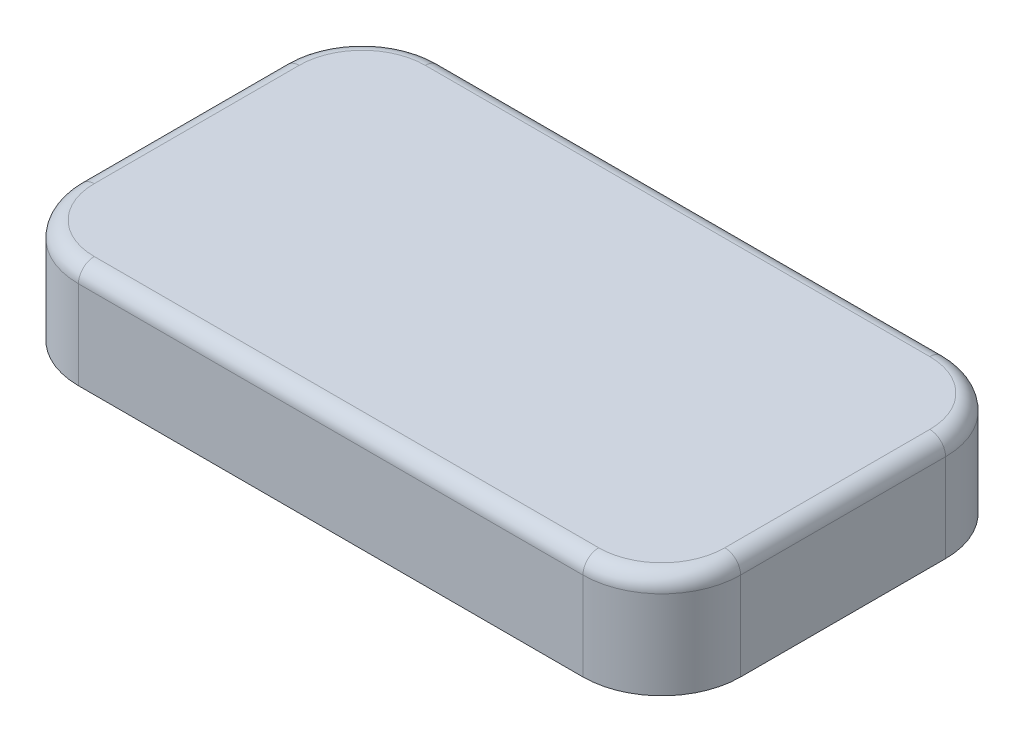
ISO-10303-21;
HEADER;
FILE_DESCRIPTION(('STEP AP214'),'2;1');
FILE_NAME('part.step','',(''),(''),'','','');
FILE_SCHEMA(('AUTOMOTIVE_DESIGN { 1 0 10303 214 1 1 1 1 }'));
ENDSEC;
DATA;
#1=APPLICATION_CONTEXT('core data for automotive mechanical design processes');
#2=APPLICATION_PROTOCOL_DEFINITION('international standard','automotive_design',2000,#1);
#3=PRODUCT_CONTEXT('',#1,'mechanical');
#4=PRODUCT('Part','Part','',(#3));
#5=PRODUCT_RELATED_PRODUCT_CATEGORY('part','',(#4));
#6=PRODUCT_DEFINITION_FORMATION('','',#4);
#7=PRODUCT_DEFINITION_CONTEXT('part definition',#1,'design');
#8=PRODUCT_DEFINITION('design','',#6,#7);
#9=PRODUCT_DEFINITION_SHAPE('','',#8);
#10=(LENGTH_UNIT() NAMED_UNIT(*) SI_UNIT(.MILLI.,.METRE.));
#11=(NAMED_UNIT(*) PLANE_ANGLE_UNIT() SI_UNIT($,.RADIAN.));
#12=(NAMED_UNIT(*) SI_UNIT($,.STERADIAN.) SOLID_ANGLE_UNIT());
#13=UNCERTAINTY_MEASURE_WITH_UNIT(LENGTH_MEASURE(1.E-05),#10,'distance_accuracy_value','');
#14=(GEOMETRIC_REPRESENTATION_CONTEXT(3) GLOBAL_UNCERTAINTY_ASSIGNED_CONTEXT((#13)) GLOBAL_UNIT_ASSIGNED_CONTEXT((#10,
#11,#12)) REPRESENTATION_CONTEXT('',''));
#15=CARTESIAN_POINT('',(0.,0.,0.));
#16=DIRECTION('',(0.,0.,1.));
#17=DIRECTION('',(1.,0.,0.));
#18=AXIS2_PLACEMENT_3D('',#15,#16,#17);
#19=CARTESIAN_POINT('',(0.,1.65,0.));
#20=DIRECTION('',(0.,1.,0.));
#21=DIRECTION('',(0.,0.,1.));
#22=AXIS2_PLACEMENT_3D('',#19,#20,#21);
#23=PLANE('',#22);
#24=DIRECTION('',(1.,0.,0.));
#25=VECTOR('',#24,1.);
#26=CARTESIAN_POINT('',(-4.0185813417536,1.65,2.625));
#27=LINE('',#26,#25);
#28=CARTESIAN_POINT('',(3.99999999998244,1.65,2.625));
#29=VERTEX_POINT('',#28);
#30=CARTESIAN_POINT('',(-3.9999999999735,1.65,2.625));
#31=VERTEX_POINT('',#30);
#32=EDGE_CURVE('E262',#29,#31,#27,.F.);
#33=ORIENTED_EDGE('',*,*,#32,.F.);
#34=CARTESIAN_POINT('',(4.,1.65,1.625));
#35=DIRECTION('',(0.,-1.,0.));
#36=DIRECTION('',(1.,0.,-1.05976208711334E-10));
#37=AXIS2_PLACEMENT_3D('',#34,#35,#36);
#38=CIRCLE('',#37,1.);
#39=CARTESIAN_POINT('',(5.,1.65,1.62499999997351));
#40=VERTEX_POINT('',#39);
#41=EDGE_CURVE('E258',#40,#29,#38,.T.);
#42=ORIENTED_EDGE('',*,*,#41,.F.);
#43=DIRECTION('',(0.,0.,-1.));
#44=VECTOR('',#43,1.);
#45=CARTESIAN_POINT('',(5.,1.65,1.64358134175361));
#46=LINE('',#45,#44);
#47=CARTESIAN_POINT('',(5.,1.65,-1.62499999998244));
#48=VERTEX_POINT('',#47);
#49=EDGE_CURVE('E247',#48,#40,#46,.F.);
#50=ORIENTED_EDGE('',*,*,#49,.F.);
#51=CARTESIAN_POINT('',(4.,1.65,-1.625));
#52=DIRECTION('',(0.,-1.,0.));
#53=DIRECTION('',(-1.05975991870899E-10,0.,-1.));
#54=AXIS2_PLACEMENT_3D('',#51,#52,#53);
#55=CIRCLE('',#54,0.999999999999999);
#56=CARTESIAN_POINT('',(3.99999999997351,1.65,-2.625));
#57=VERTEX_POINT('',#56);
#58=EDGE_CURVE('E222',#57,#48,#55,.T.);
#59=ORIENTED_EDGE('',*,*,#58,.F.);
#60=DIRECTION('',(-1.,0.,0.));
#61=VECTOR('',#60,1.);
#62=CARTESIAN_POINT('',(4.01858134175362,1.65,-2.625));
#63=LINE('',#62,#61);
#64=CARTESIAN_POINT('',(-3.99999999996487,1.65,-2.625));
#65=VERTEX_POINT('',#64);
#66=EDGE_CURVE('E117',#65,#57,#63,.F.);
#67=ORIENTED_EDGE('',*,*,#66,.F.);
#68=CARTESIAN_POINT('',(-3.99999999999999,1.65,-1.625));
#69=DIRECTION('',(0.,-1.,0.));
#70=DIRECTION('',(-1.,0.,1.05976208711334E-10));
#71=AXIS2_PLACEMENT_3D('',#68,#69,#70);
#72=CIRCLE('',#71,0.999999999999998);
#73=CARTESIAN_POINT('',(-5.,1.65,-1.62499999997351));
#74=VERTEX_POINT('',#73);
#75=EDGE_CURVE('E109',#74,#65,#72,.T.);
#76=ORIENTED_EDGE('',*,*,#75,.F.);
#77=DIRECTION('',(0.,0.,1.));
#78=VECTOR('',#77,1.);
#79=CARTESIAN_POINT('',(-5.,1.65,-1.64358134175361));
#80=LINE('',#79,#78);
#81=CARTESIAN_POINT('',(-5.,1.65,1.62499999998244));
#82=VERTEX_POINT('',#81);
#83=EDGE_CURVE('E113',#82,#74,#80,.F.);
#84=ORIENTED_EDGE('',*,*,#83,.F.);
#85=CARTESIAN_POINT('',(-3.99999999999999,1.65,1.625));
#86=DIRECTION('',(0.,-1.,0.));
#87=DIRECTION('',(1.05975991870899E-10,0.,1.));
#88=AXIS2_PLACEMENT_3D('',#85,#86,#87);
#89=CIRCLE('',#88,1.);
#90=EDGE_CURVE('E288',#31,#82,#89,.T.);
#91=ORIENTED_EDGE('',*,*,#90,.F.);
#92=EDGE_LOOP('',(#33,#42,#50,#59,#67,#76,#84,#91));
#93=FACE_BOUND('',#92,.T.);
#94=ADVANCED_FACE('F16',(#93),#23,.T.);
#95=CARTESIAN_POINT('',(-3.99999999999999,1.4,-1.625));
#96=DIRECTION('',(0.,1.,0.));
#97=DIRECTION('',(0.0148645259520508,0.,-0.999889516830845));
#98=AXIS2_PLACEMENT_3D('',#95,#96,#97);
#99=TOROIDAL_SURFACE('',#98,1.,0.25);
#100=CARTESIAN_POINT('',(-5.,1.4,-1.625));
#101=DIRECTION('',(0.,0.,1.));
#102=DIRECTION('',(1.,0.,0.));
#103=AXIS2_PLACEMENT_3D('',#100,#101,#102);
#104=CIRCLE('',#103,0.25);
#105=CARTESIAN_POINT('',(-5.25,1.4,-1.625));
#106=VERTEX_POINT('',#105);
#107=EDGE_CURVE('E123',#74,#106,#104,.T.);
#108=ORIENTED_EDGE('',*,*,#107,.F.);
#109=ORIENTED_EDGE('',*,*,#75,.T.);
#110=CARTESIAN_POINT('',(-3.99999999992975,1.4,-2.625));
#111=DIRECTION('',(-1.,0.,0.));
#112=DIRECTION('',(0.,0.,1.));
#113=AXIS2_PLACEMENT_3D('',#110,#111,#112);
#114=CIRCLE('',#113,0.25);
#115=CARTESIAN_POINT('',(-3.99999999998244,1.4,-2.875));
#116=VERTEX_POINT('',#115);
#117=EDGE_CURVE('E213',#116,#65,#114,.F.);
#118=ORIENTED_EDGE('',*,*,#117,.F.);
#119=CARTESIAN_POINT('',(-3.99999999999999,1.4,-1.625));
#120=DIRECTION('',(0.,1.,0.));
#121=DIRECTION('',(0.,0.,1.));
#122=AXIS2_PLACEMENT_3D('',#119,#120,#121);
#123=CIRCLE('',#122,1.25);
#124=EDGE_CURVE('E135',#106,#116,#123,.F.);
#125=ORIENTED_EDGE('',*,*,#124,.F.);
#126=EDGE_LOOP('',(#108,#109,#118,#125));
#127=FACE_BOUND('',#126,.T.);
#128=ADVANCED_FACE('F133',(#127),#99,.T.);
#129=CARTESIAN_POINT('',(-5.,1.4,-1.64358134175361));
#130=DIRECTION('',(0.,0.,1.));
#131=DIRECTION('',(1.,0.,0.));
#132=AXIS2_PLACEMENT_3D('',#129,#130,#131);
#133=CYLINDRICAL_SURFACE('',#132,0.25);
#134=CARTESIAN_POINT('',(-4.99999999999999,1.4,1.625));
#135=DIRECTION('',(0.,0.,1.));
#136=DIRECTION('',(-1.,0.,0.));
#137=AXIS2_PLACEMENT_3D('',#134,#135,#136);
#138=CIRCLE('',#137,0.25);
#139=CARTESIAN_POINT('',(-5.24999999999999,1.4,1.625));
#140=VERTEX_POINT('',#139);
#141=EDGE_CURVE('E131',#82,#140,#138,.T.);
#142=ORIENTED_EDGE('',*,*,#141,.F.);
#143=ORIENTED_EDGE('',*,*,#83,.T.);
#144=ORIENTED_EDGE('',*,*,#107,.T.);
#145=DIRECTION('',(0.,0.,1.));
#146=VECTOR('',#145,1.);
#147=CARTESIAN_POINT('',(-5.25,1.4,-1.625));
#148=LINE('',#147,#146);
#149=EDGE_CURVE('E203',#140,#106,#148,.F.);
#150=ORIENTED_EDGE('',*,*,#149,.F.);
#151=EDGE_LOOP('',(#142,#143,#144,#150));
#152=FACE_BOUND('',#151,.T.);
#153=ADVANCED_FACE('F128',(#152),#133,.T.);
#154=CARTESIAN_POINT('',(-3.99999999999999,1.4,1.625));
#155=DIRECTION('',(0.,1.,0.));
#156=DIRECTION('',(-0.999889516830845,0.,-0.0148645259520509));
#157=AXIS2_PLACEMENT_3D('',#154,#155,#156);
#158=TOROIDAL_SURFACE('',#157,1.,0.25);
#159=CARTESIAN_POINT('',(-3.99999999999999,1.4,2.625));
#160=DIRECTION('',(1.,0.,0.));
#161=DIRECTION('',(0.,0.,-1.));
#162=AXIS2_PLACEMENT_3D('',#159,#160,#161);
#163=CIRCLE('',#162,0.25);
#164=CARTESIAN_POINT('',(-3.99999999999999,1.4,2.875));
#165=VERTEX_POINT('',#164);
#166=EDGE_CURVE('E85',#31,#165,#163,.T.);
#167=ORIENTED_EDGE('',*,*,#166,.F.);
#168=ORIENTED_EDGE('',*,*,#90,.T.);
#169=ORIENTED_EDGE('',*,*,#141,.T.);
#170=CARTESIAN_POINT('',(-3.99999999999999,1.4,1.625));
#171=DIRECTION('',(0.,1.,0.));
#172=DIRECTION('',(0.,0.,1.));
#173=AXIS2_PLACEMENT_3D('',#170,#171,#172);
#174=CIRCLE('',#173,1.25);
#175=EDGE_CURVE('E198',#165,#140,#174,.F.);
#176=ORIENTED_EDGE('',*,*,#175,.F.);
#177=EDGE_LOOP('',(#167,#168,#169,#176));
#178=FACE_BOUND('',#177,.T.);
#179=ADVANCED_FACE('F298',(#178),#158,.T.);
#180=CARTESIAN_POINT('',(-4.0185813417536,1.4,2.625));
#181=DIRECTION('',(1.,0.,0.));
#182=DIRECTION('',(0.,0.,-1.));
#183=AXIS2_PLACEMENT_3D('',#180,#181,#182);
#184=CYLINDRICAL_SURFACE('',#183,0.25);
#185=CARTESIAN_POINT('',(4.,1.4,2.625));
#186=DIRECTION('',(1.,0.,0.));
#187=DIRECTION('',(0.,0.,1.));
#188=AXIS2_PLACEMENT_3D('',#185,#186,#187);
#189=CIRCLE('',#188,0.25);
#190=CARTESIAN_POINT('',(4.,1.4,2.875));
#191=VERTEX_POINT('',#190);
#192=EDGE_CURVE('E77',#29,#191,#189,.T.);
#193=ORIENTED_EDGE('',*,*,#192,.F.);
#194=ORIENTED_EDGE('',*,*,#32,.T.);
#195=ORIENTED_EDGE('',*,*,#166,.T.);
#196=DIRECTION('',(1.,0.,0.));
#197=VECTOR('',#196,1.);
#198=CARTESIAN_POINT('',(-3.99999999999999,1.4,2.875));
#199=LINE('',#198,#197);
#200=EDGE_CURVE('E195',#191,#165,#199,.F.);
#201=ORIENTED_EDGE('',*,*,#200,.F.);
#202=EDGE_LOOP('',(#193,#194,#195,#201));
#203=FACE_BOUND('',#202,.T.);
#204=ADVANCED_FACE('F274',(#203),#184,.T.);
#205=CARTESIAN_POINT('',(4.,1.4,1.625));
#206=DIRECTION('',(0.,1.,0.));
#207=DIRECTION('',(-0.0148645259520508,0.,0.999889516830845));
#208=AXIS2_PLACEMENT_3D('',#205,#206,#207);
#209=TOROIDAL_SURFACE('',#208,1.,0.25);
#210=CARTESIAN_POINT('',(5.,1.4,1.625));
#211=DIRECTION('',(0.,0.,-1.));
#212=DIRECTION('',(-1.,0.,0.));
#213=AXIS2_PLACEMENT_3D('',#210,#211,#212);
#214=CIRCLE('',#213,0.25);
#215=CARTESIAN_POINT('',(5.25,1.4,1.625));
#216=VERTEX_POINT('',#215);
#217=EDGE_CURVE('E70',#40,#216,#214,.T.);
#218=ORIENTED_EDGE('',*,*,#217,.F.);
#219=ORIENTED_EDGE('',*,*,#41,.T.);
#220=ORIENTED_EDGE('',*,*,#192,.T.);
#221=CARTESIAN_POINT('',(4.,1.4,1.625));
#222=DIRECTION('',(0.,1.,0.));
#223=DIRECTION('',(0.,0.,1.));
#224=AXIS2_PLACEMENT_3D('',#221,#222,#223);
#225=CIRCLE('',#224,1.25);
#226=EDGE_CURVE('E20',#216,#191,#225,.F.);
#227=ORIENTED_EDGE('',*,*,#226,.F.);
#228=EDGE_LOOP('',(#218,#219,#220,#227));
#229=FACE_BOUND('',#228,.T.);
#230=ADVANCED_FACE('F264',(#229),#209,.T.);
#231=CARTESIAN_POINT('',(5.,1.4,1.64358134175361));
#232=DIRECTION('',(0.,0.,-1.));
#233=DIRECTION('',(-1.,0.,0.));
#234=AXIS2_PLACEMENT_3D('',#231,#232,#233);
#235=CYLINDRICAL_SURFACE('',#234,0.25);
#236=CARTESIAN_POINT('',(5.,1.4,-1.625));
#237=DIRECTION('',(0.,0.,-1.));
#238=DIRECTION('',(1.,0.,0.));
#239=AXIS2_PLACEMENT_3D('',#236,#237,#238);
#240=CIRCLE('',#239,0.25);
#241=CARTESIAN_POINT('',(5.25,1.4,-1.625));
#242=VERTEX_POINT('',#241);
#243=EDGE_CURVE('E227',#48,#242,#240,.T.);
#244=ORIENTED_EDGE('',*,*,#243,.F.);
#245=ORIENTED_EDGE('',*,*,#49,.T.);
#246=ORIENTED_EDGE('',*,*,#217,.T.);
#247=DIRECTION('',(0.,0.,-1.));
#248=VECTOR('',#247,1.);
#249=CARTESIAN_POINT('',(5.25,1.4,1.625));
#250=LINE('',#249,#248);
#251=EDGE_CURVE('E182',#242,#216,#250,.F.);
#252=ORIENTED_EDGE('',*,*,#251,.F.);
#253=EDGE_LOOP('',(#244,#245,#246,#252));
#254=FACE_BOUND('',#253,.T.);
#255=ADVANCED_FACE('F236',(#254),#235,.T.);
#256=CARTESIAN_POINT('',(4.,1.4,-1.625));
#257=DIRECTION('',(0.,1.,0.));
#258=DIRECTION('',(0.999889516830845,0.,0.0148645259520506));
#259=AXIS2_PLACEMENT_3D('',#256,#257,#258);
#260=TOROIDAL_SURFACE('',#259,1.,0.25);
#261=CARTESIAN_POINT('',(4.00000000000001,1.4,-2.625));
#262=DIRECTION('',(-1.,0.,0.));
#263=DIRECTION('',(0.,0.,1.));
#264=AXIS2_PLACEMENT_3D('',#261,#262,#263);
#265=CIRCLE('',#264,0.25);
#266=CARTESIAN_POINT('',(4.,1.4,-2.875));
#267=VERTEX_POINT('',#266);
#268=EDGE_CURVE('E215',#57,#267,#265,.T.);
#269=ORIENTED_EDGE('',*,*,#268,.F.);
#270=ORIENTED_EDGE('',*,*,#58,.T.);
#271=ORIENTED_EDGE('',*,*,#243,.T.);
#272=CARTESIAN_POINT('',(4.,1.4,-1.625));
#273=DIRECTION('',(0.,1.,0.));
#274=DIRECTION('',(0.,0.,1.));
#275=AXIS2_PLACEMENT_3D('',#272,#273,#274);
#276=CIRCLE('',#275,1.25);
#277=EDGE_CURVE('E174',#267,#242,#276,.F.);
#278=ORIENTED_EDGE('',*,*,#277,.F.);
#279=EDGE_LOOP('',(#269,#270,#271,#278));
#280=FACE_BOUND('',#279,.T.);
#281=ADVANCED_FACE('F230',(#280),#260,.T.);
#282=CARTESIAN_POINT('',(4.01858134175362,1.4,-2.625));
#283=DIRECTION('',(-1.,0.,0.));
#284=DIRECTION('',(0.,0.,1.));
#285=AXIS2_PLACEMENT_3D('',#282,#283,#284);
#286=CYLINDRICAL_SURFACE('',#285,0.25);
#287=ORIENTED_EDGE('',*,*,#117,.T.);
#288=ORIENTED_EDGE('',*,*,#66,.T.);
#289=ORIENTED_EDGE('',*,*,#268,.T.);
#290=DIRECTION('',(-1.,0.,0.));
#291=VECTOR('',#290,1.);
#292=CARTESIAN_POINT('',(4.,1.4,-2.875));
#293=LINE('',#292,#291);
#294=EDGE_CURVE('E173',#116,#267,#293,.F.);
#295=ORIENTED_EDGE('',*,*,#294,.F.);
#296=EDGE_LOOP('',(#287,#288,#289,#295));
#297=FACE_BOUND('',#296,.T.);
#298=ADVANCED_FACE('F235',(#297),#286,.T.);
#299=CARTESIAN_POINT('',(-3.99999999999999,0.,-1.625));
#300=DIRECTION('',(0.,1.,0.));
#301=DIRECTION('',(0.,0.,1.));
#302=AXIS2_PLACEMENT_3D('',#299,#300,#301);
#303=CYLINDRICAL_SURFACE('',#302,1.25);
#304=DIRECTION('',(0.,1.,0.));
#305=VECTOR('',#304,1.);
#306=CARTESIAN_POINT('',(-5.25,0.,-1.625));
#307=LINE('',#306,#305);
#308=CARTESIAN_POINT('',(-5.25,0.,-1.625));
#309=VERTEX_POINT('',#308);
#310=EDGE_CURVE('E206',#106,#309,#307,.F.);
#311=ORIENTED_EDGE('',*,*,#310,.F.);
#312=ORIENTED_EDGE('',*,*,#124,.T.);
#313=DIRECTION('',(0.,1.,0.));
#314=VECTOR('',#313,1.);
#315=CARTESIAN_POINT('',(-4.,0.,-2.875));
#316=LINE('',#315,#314);
#317=CARTESIAN_POINT('',(-4.,0.,-2.875));
#318=VERTEX_POINT('',#317);
#319=EDGE_CURVE('E180',#318,#116,#316,.T.);
#320=ORIENTED_EDGE('',*,*,#319,.F.);
#321=CARTESIAN_POINT('',(-3.99999999999999,0.,-1.625));
#322=DIRECTION('',(0.,1.,0.));
#323=DIRECTION('',(0.,0.,1.));
#324=AXIS2_PLACEMENT_3D('',#321,#322,#323);
#325=CIRCLE('',#324,1.25);
#326=EDGE_CURVE('E171',#318,#309,#325,.T.);
#327=ORIENTED_EDGE('',*,*,#326,.T.);
#328=EDGE_LOOP('',(#311,#312,#320,#327));
#329=FACE_BOUND('',#328,.T.);
#330=ADVANCED_FACE('F327',(#329),#303,.T.);
#331=CARTESIAN_POINT('',(-5.25,0.,-1.625));
#332=DIRECTION('',(-1.,0.,0.));
#333=DIRECTION('',(0.,0.,1.));
#334=AXIS2_PLACEMENT_3D('',#331,#332,#333);
#335=PLANE('',#334);
#336=DIRECTION('',(0.,1.,0.));
#337=VECTOR('',#336,1.);
#338=CARTESIAN_POINT('',(-5.24999999999999,0.,1.625));
#339=LINE('',#338,#337);
#340=CARTESIAN_POINT('',(-5.25,0.,1.625));
#341=VERTEX_POINT('',#340);
#342=EDGE_CURVE('E201',#140,#341,#339,.F.);
#343=ORIENTED_EDGE('',*,*,#342,.F.);
#344=ORIENTED_EDGE('',*,*,#149,.T.);
#345=ORIENTED_EDGE('',*,*,#310,.T.);
#346=DIRECTION('',(0.,0.,1.));
#347=VECTOR('',#346,1.);
#348=CARTESIAN_POINT('',(-5.25,0.,0.));
#349=LINE('',#348,#347);
#350=EDGE_CURVE('E170',#309,#341,#349,.T.);
#351=ORIENTED_EDGE('',*,*,#350,.T.);
#352=EDGE_LOOP('',(#343,#344,#345,#351));
#353=FACE_BOUND('',#352,.T.);
#354=ADVANCED_FACE('F357',(#353),#335,.T.);
#355=CARTESIAN_POINT('',(-3.99999999999999,0.,1.625));
#356=DIRECTION('',(0.,1.,0.));
#357=DIRECTION('',(0.,0.,1.));
#358=AXIS2_PLACEMENT_3D('',#355,#356,#357);
#359=CYLINDRICAL_SURFACE('',#358,1.25);
#360=DIRECTION('',(0.,1.,0.));
#361=VECTOR('',#360,1.);
#362=CARTESIAN_POINT('',(-3.99999999999999,0.,2.875));
#363=LINE('',#362,#361);
#364=CARTESIAN_POINT('',(-3.99999999999999,0.,2.875));
#365=VERTEX_POINT('',#364);
#366=EDGE_CURVE('E196',#165,#365,#363,.F.);
#367=ORIENTED_EDGE('',*,*,#366,.F.);
#368=ORIENTED_EDGE('',*,*,#175,.T.);
#369=ORIENTED_EDGE('',*,*,#342,.T.);
#370=CARTESIAN_POINT('',(-3.99999999999999,0.,1.625));
#371=DIRECTION('',(0.,1.,0.));
#372=DIRECTION('',(0.,0.,1.));
#373=AXIS2_PLACEMENT_3D('',#370,#371,#372);
#374=CIRCLE('',#373,1.25);
#375=EDGE_CURVE('E167',#341,#365,#374,.T.);
#376=ORIENTED_EDGE('',*,*,#375,.T.);
#377=EDGE_LOOP('',(#367,#368,#369,#376));
#378=FACE_BOUND('',#377,.T.);
#379=ADVANCED_FACE('F359',(#378),#359,.T.);
#380=CARTESIAN_POINT('',(-3.99999999999999,0.,2.875));
#381=DIRECTION('',(0.,0.,1.));
#382=DIRECTION('',(1.,0.,0.));
#383=AXIS2_PLACEMENT_3D('',#380,#381,#382);
#384=PLANE('',#383);
#385=DIRECTION('',(0.,1.,0.));
#386=VECTOR('',#385,1.);
#387=CARTESIAN_POINT('',(4.,0.,2.875));
#388=LINE('',#387,#386);
#389=CARTESIAN_POINT('',(4.,0.,2.875));
#390=VERTEX_POINT('',#389);
#391=EDGE_CURVE('E193',#191,#390,#388,.F.);
#392=ORIENTED_EDGE('',*,*,#391,.F.);
#393=ORIENTED_EDGE('',*,*,#200,.T.);
#394=ORIENTED_EDGE('',*,*,#366,.T.);
#395=DIRECTION('',(1.,0.,0.));
#396=VECTOR('',#395,1.);
#397=CARTESIAN_POINT('',(0.,0.,2.875));
#398=LINE('',#397,#396);
#399=EDGE_CURVE('E166',#365,#390,#398,.T.);
#400=ORIENTED_EDGE('',*,*,#399,.T.);
#401=EDGE_LOOP('',(#392,#393,#394,#400));
#402=FACE_BOUND('',#401,.T.);
#403=ADVANCED_FACE('F348',(#402),#384,.T.);
#404=CARTESIAN_POINT('',(4.,0.,1.625));
#405=DIRECTION('',(0.,1.,0.));
#406=DIRECTION('',(0.,0.,1.));
#407=AXIS2_PLACEMENT_3D('',#404,#405,#406);
#408=CYLINDRICAL_SURFACE('',#407,1.25);
#409=DIRECTION('',(0.,1.,0.));
#410=VECTOR('',#409,1.);
#411=CARTESIAN_POINT('',(5.25,0.,1.625));
#412=LINE('',#411,#410);
#413=CARTESIAN_POINT('',(5.25,0.,1.625));
#414=VERTEX_POINT('',#413);
#415=EDGE_CURVE('E186',#216,#414,#412,.F.);
#416=ORIENTED_EDGE('',*,*,#415,.F.);
#417=ORIENTED_EDGE('',*,*,#226,.T.);
#418=ORIENTED_EDGE('',*,*,#391,.T.);
#419=CARTESIAN_POINT('',(4.,0.,1.625));
#420=DIRECTION('',(0.,1.,0.));
#421=DIRECTION('',(0.,0.,1.));
#422=AXIS2_PLACEMENT_3D('',#419,#420,#421);
#423=CIRCLE('',#422,1.25);
#424=EDGE_CURVE('E163',#390,#414,#423,.T.);
#425=ORIENTED_EDGE('',*,*,#424,.T.);
#426=EDGE_LOOP('',(#416,#417,#418,#425));
#427=FACE_BOUND('',#426,.T.);
#428=ADVANCED_FACE('F339',(#427),#408,.T.);
#429=CARTESIAN_POINT('',(5.25,0.,1.625));
#430=DIRECTION('',(1.,0.,0.));
#431=DIRECTION('',(0.,0.,-1.));
#432=AXIS2_PLACEMENT_3D('',#429,#430,#431);
#433=PLANE('',#432);
#434=DIRECTION('',(0.,1.,0.));
#435=VECTOR('',#434,1.);
#436=CARTESIAN_POINT('',(5.25,0.,-1.625));
#437=LINE('',#436,#435);
#438=CARTESIAN_POINT('',(5.25,0.,-1.625));
#439=VERTEX_POINT('',#438);
#440=EDGE_CURVE('E176',#242,#439,#437,.F.);
#441=ORIENTED_EDGE('',*,*,#440,.F.);
#442=ORIENTED_EDGE('',*,*,#251,.T.);
#443=ORIENTED_EDGE('',*,*,#415,.T.);
#444=DIRECTION('',(0.,0.,1.));
#445=VECTOR('',#444,1.);
#446=CARTESIAN_POINT('',(5.25,0.,0.));
#447=LINE('',#446,#445);
#448=EDGE_CURVE('E162',#414,#439,#447,.F.);
#449=ORIENTED_EDGE('',*,*,#448,.T.);
#450=EDGE_LOOP('',(#441,#442,#443,#449));
#451=FACE_BOUND('',#450,.T.);
#452=ADVANCED_FACE('F335',(#451),#433,.T.);
#453=CARTESIAN_POINT('',(4.,0.,-1.625));
#454=DIRECTION('',(0.,1.,0.));
#455=DIRECTION('',(0.,0.,1.));
#456=AXIS2_PLACEMENT_3D('',#453,#454,#455);
#457=CYLINDRICAL_SURFACE('',#456,1.25);
#458=DIRECTION('',(0.,1.,0.));
#459=VECTOR('',#458,1.);
#460=CARTESIAN_POINT('',(4.,0.,-2.875));
#461=LINE('',#460,#459);
#462=CARTESIAN_POINT('',(4.,0.,-2.875));
#463=VERTEX_POINT('',#462);
#464=EDGE_CURVE('E34',#267,#463,#461,.F.);
#465=ORIENTED_EDGE('',*,*,#464,.F.);
#466=ORIENTED_EDGE('',*,*,#277,.T.);
#467=ORIENTED_EDGE('',*,*,#440,.T.);
#468=CARTESIAN_POINT('',(4.,0.,-1.625));
#469=DIRECTION('',(0.,1.,0.));
#470=DIRECTION('',(0.,0.,1.));
#471=AXIS2_PLACEMENT_3D('',#468,#469,#470);
#472=CIRCLE('',#471,1.25);
#473=EDGE_CURVE('E26',#439,#463,#472,.T.);
#474=ORIENTED_EDGE('',*,*,#473,.T.);
#475=EDGE_LOOP('',(#465,#466,#467,#474));
#476=FACE_BOUND('',#475,.T.);
#477=ADVANCED_FACE('F374',(#476),#457,.T.);
#478=CARTESIAN_POINT('',(4.,0.,-2.875));
#479=DIRECTION('',(0.,0.,-1.));
#480=DIRECTION('',(-1.,0.,0.));
#481=AXIS2_PLACEMENT_3D('',#478,#479,#480);
#482=PLANE('',#481);
#483=ORIENTED_EDGE('',*,*,#319,.T.);
#484=ORIENTED_EDGE('',*,*,#294,.T.);
#485=ORIENTED_EDGE('',*,*,#464,.T.);
#486=DIRECTION('',(1.,0.,0.));
#487=VECTOR('',#486,1.);
#488=CARTESIAN_POINT('',(0.,0.,-2.875));
#489=LINE('',#488,#487);
#490=EDGE_CURVE('E11',#463,#318,#489,.F.);
#491=ORIENTED_EDGE('',*,*,#490,.T.);
#492=EDGE_LOOP('',(#483,#484,#485,#491));
#493=FACE_BOUND('',#492,.T.);
#494=ADVANCED_FACE('F328',(#493),#482,.T.);
#495=CARTESIAN_POINT('',(0.,0.,0.));
#496=DIRECTION('',(0.,1.,0.));
#497=DIRECTION('',(0.,0.,1.));
#498=AXIS2_PLACEMENT_3D('',#495,#496,#497);
#499=PLANE('',#498);
#500=ORIENTED_EDGE('',*,*,#473,.F.);
#501=ORIENTED_EDGE('',*,*,#448,.F.);
#502=ORIENTED_EDGE('',*,*,#424,.F.);
#503=ORIENTED_EDGE('',*,*,#399,.F.);
#504=ORIENTED_EDGE('',*,*,#375,.F.);
#505=ORIENTED_EDGE('',*,*,#350,.F.);
#506=ORIENTED_EDGE('',*,*,#326,.F.);
#507=ORIENTED_EDGE('',*,*,#490,.F.);
#508=EDGE_LOOP('',(#500,#501,#502,#503,#504,#505,#506,#507));
#509=FACE_BOUND('',#508,.T.);
#510=ADVANCED_FACE('F345',(#509),#499,.F.);
#511=CLOSED_SHELL('',(#94,#128,#153,#179,#204,#230,#255,#281,#298,#330,#354,#379,#403,#428,#452,
#477,#494,#510));
#512=MANIFOLD_SOLID_BREP('B1',#511);
#513=ADVANCED_BREP_SHAPE_REPRESENTATION('',(#18,#512),#14);
#514=SHAPE_DEFINITION_REPRESENTATION(#9,#513);
ENDSEC;
END-ISO-10303-21;
